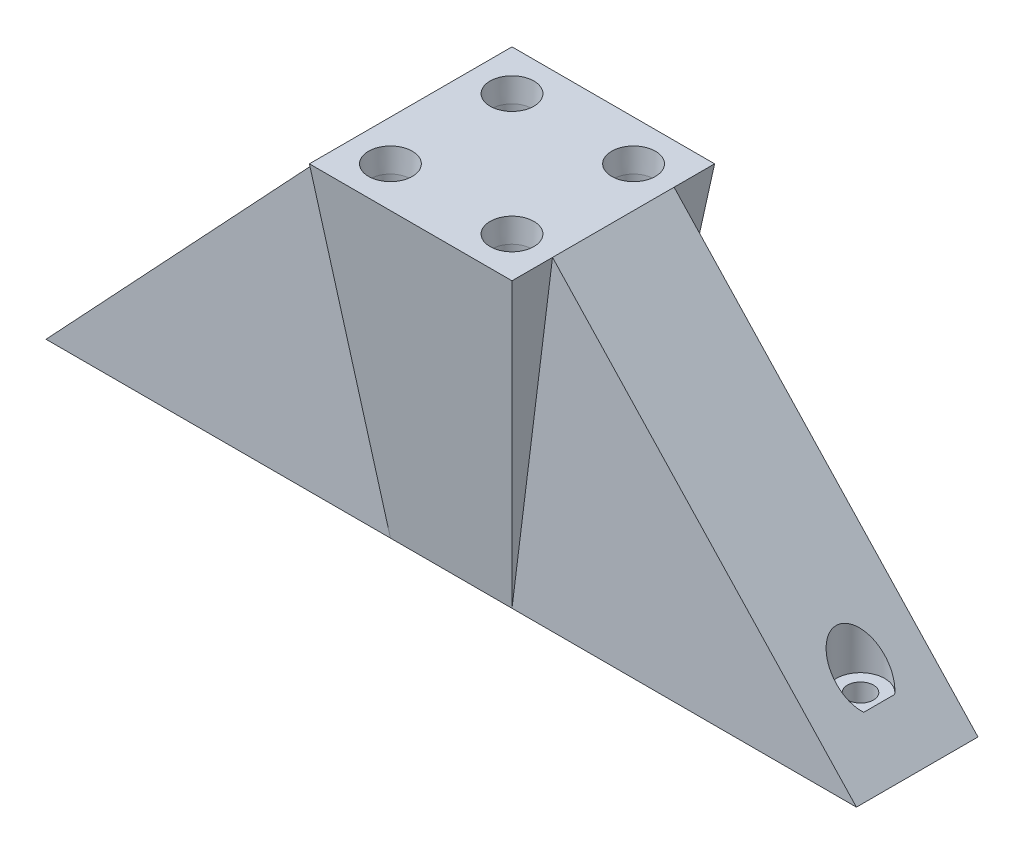
ISO-10303-21;
HEADER;
FILE_DESCRIPTION(('STEP AP214'),'2;1');
FILE_NAME('part.step','',(''),(''),'','','');
FILE_SCHEMA(('AUTOMOTIVE_DESIGN { 1 0 10303 214 1 1 1 1 }'));
ENDSEC;
DATA;
#1=APPLICATION_CONTEXT('core data for automotive mechanical design processes');
#2=APPLICATION_PROTOCOL_DEFINITION('international standard','automotive_design',2000,#1);
#3=PRODUCT_CONTEXT('',#1,'mechanical');
#4=PRODUCT('Part','Part','',(#3));
#5=PRODUCT_RELATED_PRODUCT_CATEGORY('part','',(#4));
#6=PRODUCT_DEFINITION_FORMATION('','',#4);
#7=PRODUCT_DEFINITION_CONTEXT('part definition',#1,'design');
#8=PRODUCT_DEFINITION('design','',#6,#7);
#9=PRODUCT_DEFINITION_SHAPE('','',#8);
#10=(LENGTH_UNIT() NAMED_UNIT(*) SI_UNIT(.MILLI.,.METRE.));
#11=(NAMED_UNIT(*) PLANE_ANGLE_UNIT() SI_UNIT($,.RADIAN.));
#12=(NAMED_UNIT(*) SI_UNIT($,.STERADIAN.) SOLID_ANGLE_UNIT());
#13=UNCERTAINTY_MEASURE_WITH_UNIT(LENGTH_MEASURE(1.E-05),#10,'distance_accuracy_value','');
#14=(GEOMETRIC_REPRESENTATION_CONTEXT(3) GLOBAL_UNCERTAINTY_ASSIGNED_CONTEXT((#13)) GLOBAL_UNIT_ASSIGNED_CONTEXT((#10,
#11,#12)) REPRESENTATION_CONTEXT('',''));
#15=CARTESIAN_POINT('',(0.,0.,0.));
#16=DIRECTION('',(0.,0.,1.));
#17=DIRECTION('',(1.,0.,0.));
#18=AXIS2_PLACEMENT_3D('',#15,#16,#17);
#19=CARTESIAN_POINT('',(-12.499988407975,40.,12.500988407975));
#20=DIRECTION('',(-0.729537098649694,0.683941241404396,0.));
#21=DIRECTION('',(-0.683941241404396,-0.729537098649694,0.));
#22=AXIS2_PLACEMENT_3D('',#19,#20,#21);
#23=PLANE('',#22);
#24=DIRECTION('',(0.,0.,-1.));
#25=VECTOR('',#24,1.);
#26=CARTESIAN_POINT('',(-12.499988407975,40.,12.500988407975));
#27=LINE('',#26,#25);
#28=CARTESIAN_POINT('',(-12.499988407975,40.,7.5));
#29=VERTEX_POINT('',#28);
#30=CARTESIAN_POINT('',(-12.499988407975,40.,-7.5));
#31=VERTEX_POINT('',#30);
#32=EDGE_CURVE('E179',#29,#31,#27,.T.);
#33=ORIENTED_EDGE('',*,*,#32,.T.);
#34=DIRECTION('',(0.683941241404396,0.729537098649694,0.));
#35=VECTOR('',#34,1.);
#36=CARTESIAN_POINT('',(-12.499988407975,40.,-7.5));
#37=LINE('',#36,#35);
#38=CARTESIAN_POINT('',(-50.,0.,-7.5));
#39=VERTEX_POINT('',#38);
#40=EDGE_CURVE('E176',#39,#31,#37,.T.);
#41=ORIENTED_EDGE('',*,*,#40,.F.);
#42=DIRECTION('',(0.,0.,1.));
#43=VECTOR('',#42,1.);
#44=CARTESIAN_POINT('',(-50.,0.,0.));
#45=LINE('',#44,#43);
#46=CARTESIAN_POINT('',(-50.,0.,7.5));
#47=VERTEX_POINT('',#46);
#48=EDGE_CURVE('E215',#39,#47,#45,.T.);
#49=ORIENTED_EDGE('',*,*,#48,.T.);
#50=DIRECTION('',(-0.683941241404396,-0.729537098649694,0.));
#51=VECTOR('',#50,1.);
#52=CARTESIAN_POINT('',(-12.499988407975,40.,7.5));
#53=LINE('',#52,#51);
#54=EDGE_CURVE('E181',#29,#47,#53,.T.);
#55=ORIENTED_EDGE('',*,*,#54,.F.);
#56=EDGE_LOOP('',(#33,#41,#49,#55));
#57=FACE_BOUND('',#56,.T.);
#58=DIRECTION('',(0.,0.,1.));
#59=VECTOR('',#58,1.);
#60=CARTESIAN_POINT('',(-45.3124985509969,5.,0.));
#61=LINE('',#60,#59);
#62=CARTESIAN_POINT('',(-45.3124985509969,5.,-1.91111235976259));
#63=VERTEX_POINT('',#62);
#64=CARTESIAN_POINT('',(-45.3124985509969,5.,1.91111235976259));
#65=VERTEX_POINT('',#64);
#66=EDGE_CURVE('E173',#63,#65,#61,.T.);
#67=ORIENTED_EDGE('',*,*,#66,.F.);
#68=CARTESIAN_POINT('',(-43.,7.46666435856641,0.));
#69=DIRECTION('',(0.729537098649694,-0.683941241404396,0.));
#70=DIRECTION('',(-0.683941241404396,-0.729537098649694,0.));
#71=AXIS2_PLACEMENT_3D('',#68,#69,#70);
#72=ELLIPSE('',#71,4.38634171824445,3.);
#73=EDGE_CURVE('E170',#63,#65,#72,.T.);
#74=ORIENTED_EDGE('',*,*,#73,.T.);
#75=EDGE_LOOP('',(#67,#74));
#76=FACE_BOUND('',#75,.T.);
#77=ADVANCED_FACE('F34',(#57,#76),#23,.T.);
#78=CARTESIAN_POINT('',(0.,40.,0.));
#79=DIRECTION('',(0.,1.,0.));
#80=DIRECTION('',(0.,0.,1.));
#81=AXIS2_PLACEMENT_3D('',#78,#79,#80);
#82=PLANE('',#81);
#83=CARTESIAN_POINT('',(7.50001159202505,40.,7.50001159202505));
#84=DIRECTION('',(0.,1.,0.));
#85=DIRECTION('',(0.,0.,1.));
#86=AXIS2_PLACEMENT_3D('',#83,#84,#85);
#87=CIRCLE('',#86,2.7);
#88=CARTESIAN_POINT('',(7.50001159202505,40.,10.200011592025));
#89=VERTEX_POINT('',#88);
#90=EDGE_CURVE('E140',#89,#89,#87,.T.);
#91=ORIENTED_EDGE('',*,*,#90,.F.);
#92=EDGE_LOOP('',(#91));
#93=FACE_BOUND('',#92,.T.);
#94=CARTESIAN_POINT('',(-7.49998840797495,40.,7.50001159202505));
#95=DIRECTION('',(0.,1.,0.));
#96=DIRECTION('',(0.,0.,1.));
#97=AXIS2_PLACEMENT_3D('',#94,#95,#96);
#98=CIRCLE('',#97,2.7);
#99=CARTESIAN_POINT('',(-7.49998840797495,40.,10.200011592025));
#100=VERTEX_POINT('',#99);
#101=EDGE_CURVE('E133',#100,#100,#98,.T.);
#102=ORIENTED_EDGE('',*,*,#101,.F.);
#103=EDGE_LOOP('',(#102));
#104=FACE_BOUND('',#103,.T.);
#105=CARTESIAN_POINT('',(7.50001159202505,40.,-7.49998840797495));
#106=DIRECTION('',(0.,1.,0.));
#107=DIRECTION('',(0.,0.,1.));
#108=AXIS2_PLACEMENT_3D('',#105,#106,#107);
#109=CIRCLE('',#108,2.7);
#110=CARTESIAN_POINT('',(7.50001159202505,40.,-4.79998840797495));
#111=VERTEX_POINT('',#110);
#112=EDGE_CURVE('E149',#111,#111,#109,.T.);
#113=ORIENTED_EDGE('',*,*,#112,.F.);
#114=EDGE_LOOP('',(#113));
#115=FACE_BOUND('',#114,.T.);
#116=CARTESIAN_POINT('',(-7.49998840797495,40.,-7.49998840797495));
#117=DIRECTION('',(0.,1.,0.));
#118=DIRECTION('',(0.,0.,1.));
#119=AXIS2_PLACEMENT_3D('',#116,#117,#118);
#120=CIRCLE('',#119,2.7);
#121=CARTESIAN_POINT('',(-7.49998840797495,40.,-4.79998840797495));
#122=VERTEX_POINT('',#121);
#123=EDGE_CURVE('E158',#122,#122,#120,.T.);
#124=ORIENTED_EDGE('',*,*,#123,.F.);
#125=EDGE_LOOP('',(#124));
#126=FACE_BOUND('',#125,.T.);
#127=DIRECTION('',(0.,0.,-1.));
#128=VECTOR('',#127,1.);
#129=CARTESIAN_POINT('',(-12.499988407975,40.,0.));
#130=LINE('',#129,#128);
#131=CARTESIAN_POINT('',(-12.499988407975,40.,-12.499988407975));
#132=VERTEX_POINT('',#131);
#133=EDGE_CURVE('E251',#132,#31,#130,.F.);
#134=ORIENTED_EDGE('',*,*,#133,.T.);
#135=ORIENTED_EDGE('',*,*,#32,.F.);
#136=CARTESIAN_POINT('',(-12.499988407975,40.,12.499988407975));
#137=VERTEX_POINT('',#136);
#138=EDGE_CURVE('E250',#29,#137,#130,.F.);
#139=ORIENTED_EDGE('',*,*,#138,.T.);
#140=DIRECTION('',(-1.,0.,0.));
#141=VECTOR('',#140,1.);
#142=CARTESIAN_POINT('',(0.,40.,12.499988407975));
#143=LINE('',#142,#141);
#144=CARTESIAN_POINT('',(12.499988407975,40.,12.499988407975));
#145=VERTEX_POINT('',#144);
#146=EDGE_CURVE('E240',#137,#145,#143,.F.);
#147=ORIENTED_EDGE('',*,*,#146,.T.);
#148=DIRECTION('',(0.,0.,1.));
#149=VECTOR('',#148,1.);
#150=CARTESIAN_POINT('',(12.499988407975,40.,0.));
#151=LINE('',#150,#149);
#152=CARTESIAN_POINT('',(12.499988407975,40.,7.5));
#153=VERTEX_POINT('',#152);
#154=EDGE_CURVE('E234',#153,#145,#151,.T.);
#155=ORIENTED_EDGE('',*,*,#154,.F.);
#156=DIRECTION('',(0.,0.,-1.));
#157=VECTOR('',#156,1.);
#158=CARTESIAN_POINT('',(12.499988407975,40.,12.500988407975));
#159=LINE('',#158,#157);
#160=CARTESIAN_POINT('',(12.499988407975,40.,-7.5));
#161=VERTEX_POINT('',#160);
#162=EDGE_CURVE('E197',#153,#161,#159,.T.);
#163=ORIENTED_EDGE('',*,*,#162,.T.);
#164=CARTESIAN_POINT('',(12.499988407975,40.,-12.499988407975));
#165=VERTEX_POINT('',#164);
#166=EDGE_CURVE('E244',#165,#161,#151,.T.);
#167=ORIENTED_EDGE('',*,*,#166,.F.);
#168=DIRECTION('',(1.,0.,0.));
#169=VECTOR('',#168,1.);
#170=CARTESIAN_POINT('',(0.,40.,-12.499988407975));
#171=LINE('',#170,#169);
#172=EDGE_CURVE('E247',#132,#165,#171,.T.);
#173=ORIENTED_EDGE('',*,*,#172,.F.);
#174=EDGE_LOOP('',(#134,#135,#139,#147,#155,#163,#167,#173));
#175=FACE_BOUND('',#174,.T.);
#176=ADVANCED_FACE('F278',(#93,#104,#115,#126,#175),#82,.T.);
#177=CARTESIAN_POINT('',(0.,85.0693909432999,-7.5));
#178=DIRECTION('',(0.,0.,-1.));
#179=DIRECTION('',(-1.,0.,0.));
#180=AXIS2_PLACEMENT_3D('',#177,#178,#179);
#181=PLANE('',#180);
#182=DIRECTION('',(1.,0.,0.));
#183=VECTOR('',#182,1.);
#184=CARTESIAN_POINT('',(0.,0.,-7.5));
#185=LINE('',#184,#183);
#186=CARTESIAN_POINT('',(-7.5,0.,-7.5));
#187=VERTEX_POINT('',#186);
#188=EDGE_CURVE('E219',#39,#187,#185,.T.);
#189=ORIENTED_EDGE('',*,*,#188,.F.);
#190=ORIENTED_EDGE('',*,*,#40,.T.);
#191=DIRECTION('',(0.124034451450486,-0.992277912105967,0.));
#192=VECTOR('',#191,1.);
#193=CARTESIAN_POINT('',(-7.5,0.,-7.5));
#194=LINE('',#193,#192);
#195=EDGE_CURVE('E226',#187,#31,#194,.F.);
#196=ORIENTED_EDGE('',*,*,#195,.F.);
#197=EDGE_LOOP('',(#189,#190,#196));
#198=FACE_BOUND('',#197,.T.);
#199=ADVANCED_FACE('F283',(#198),#181,.T.);
#200=CARTESIAN_POINT('',(0.,85.0693909432999,7.5));
#201=DIRECTION('',(0.,0.,-1.));
#202=DIRECTION('',(-1.,0.,0.));
#203=AXIS2_PLACEMENT_3D('',#200,#201,#202);
#204=PLANE('',#203);
#205=ORIENTED_EDGE('',*,*,#54,.T.);
#206=DIRECTION('',(1.,0.,0.));
#207=VECTOR('',#206,1.);
#208=CARTESIAN_POINT('',(0.,0.,7.5));
#209=LINE('',#208,#207);
#210=CARTESIAN_POINT('',(-7.5,0.,7.5));
#211=VERTEX_POINT('',#210);
#212=EDGE_CURVE('E216',#47,#211,#209,.T.);
#213=ORIENTED_EDGE('',*,*,#212,.T.);
#214=DIRECTION('',(0.124034451450486,-0.992277912105967,0.));
#215=VECTOR('',#214,1.);
#216=CARTESIAN_POINT('',(-7.5,0.,7.5));
#217=LINE('',#216,#215);
#218=EDGE_CURVE('E223',#211,#29,#217,.F.);
#219=ORIENTED_EDGE('',*,*,#218,.T.);
#220=EDGE_LOOP('',(#205,#213,#219));
#221=FACE_BOUND('',#220,.T.);
#222=ADVANCED_FACE('F363',(#221),#204,.F.);
#223=CARTESIAN_POINT('',(7.5,0.,0.));
#224=DIRECTION('',(0.992277912105967,-0.124034451450486,0.));
#225=DIRECTION('',(0.124034451450486,0.992277912105967,0.));
#226=AXIS2_PLACEMENT_3D('',#223,#224,#225);
#227=PLANE('',#226);
#228=DIRECTION('',(0.12309121425113,0.984731997016632,0.12309121425113));
#229=VECTOR('',#228,1.);
#230=CARTESIAN_POINT('',(7.38636414730637,-0.909088929185378,7.38636414730637));
#231=LINE('',#230,#229);
#232=CARTESIAN_POINT('',(7.5,0.,7.5));
#233=VERTEX_POINT('',#232);
#234=EDGE_CURVE('E236',#145,#233,#231,.F.);
#235=ORIENTED_EDGE('',*,*,#234,.T.);
#236=DIRECTION('',(0.124034451450486,0.992277912105967,0.));
#237=VECTOR('',#236,1.);
#238=CARTESIAN_POINT('',(7.5,0.,7.5));
#239=LINE('',#238,#237);
#240=EDGE_CURVE('E212',#233,#153,#239,.T.);
#241=ORIENTED_EDGE('',*,*,#240,.T.);
#242=ORIENTED_EDGE('',*,*,#154,.T.);
#243=EDGE_LOOP('',(#235,#241,#242));
#244=FACE_BOUND('',#243,.T.);
#245=ADVANCED_FACE('F374',(#244),#227,.T.);
#246=CARTESIAN_POINT('',(-7.5,0.,0.));
#247=DIRECTION('',(-0.992277912105967,-0.124034451450486,0.));
#248=DIRECTION('',(0.124034451450486,-0.992277912105967,0.));
#249=AXIS2_PLACEMENT_3D('',#246,#247,#248);
#250=PLANE('',#249);
#251=ORIENTED_EDGE('',*,*,#218,.F.);
#252=DIRECTION('',(0.12309121425113,-0.984731997016632,-0.12309121425113));
#253=VECTOR('',#252,1.);
#254=CARTESIAN_POINT('',(-7.38636414730637,-0.909088929185378,7.38636414730637));
#255=LINE('',#254,#253);
#256=EDGE_CURVE('E239',#137,#211,#255,.T.);
#257=ORIENTED_EDGE('',*,*,#256,.F.);
#258=ORIENTED_EDGE('',*,*,#138,.F.);
#259=EDGE_LOOP('',(#251,#257,#258));
#260=FACE_BOUND('',#259,.T.);
#261=ADVANCED_FACE('F367',(#260),#250,.T.);
#262=DIRECTION('',(0.124034451450486,0.992277912105967,0.));
#263=VECTOR('',#262,1.);
#264=CARTESIAN_POINT('',(7.5,0.,-7.5));
#265=LINE('',#264,#263);
#266=CARTESIAN_POINT('',(7.5,0.,-7.5));
#267=VERTEX_POINT('',#266);
#268=EDGE_CURVE('E207',#267,#161,#265,.T.);
#269=ORIENTED_EDGE('',*,*,#268,.F.);
#270=DIRECTION('',(-0.12309121425113,-0.984731997016632,0.12309121425113));
#271=VECTOR('',#270,1.);
#272=CARTESIAN_POINT('',(7.38636414730637,-0.909088929185378,-7.38636414730637));
#273=LINE('',#272,#271);
#274=EDGE_CURVE('E11',#165,#267,#273,.T.);
#275=ORIENTED_EDGE('',*,*,#274,.F.);
#276=ORIENTED_EDGE('',*,*,#166,.T.);
#277=EDGE_LOOP('',(#269,#275,#276));
#278=FACE_BOUND('',#277,.T.);
#279=ADVANCED_FACE('F386',(#278),#227,.T.);
#280=CARTESIAN_POINT('',(0.,0.,-7.5));
#281=DIRECTION('',(0.,-0.124034451450486,-0.992277912105967));
#282=DIRECTION('',(0.,0.992277912105967,-0.124034451450486));
#283=AXIS2_PLACEMENT_3D('',#280,#281,#282);
#284=PLANE('',#283);
#285=DIRECTION('',(1.,0.,0.));
#286=VECTOR('',#285,1.);
#287=CARTESIAN_POINT('',(0.,0.,-7.5));
#288=LINE('',#287,#286);
#289=EDGE_CURVE('E229',#187,#267,#288,.T.);
#290=ORIENTED_EDGE('',*,*,#289,.F.);
#291=DIRECTION('',(-0.12309121425113,0.984731997016632,-0.12309121425113));
#292=VECTOR('',#291,1.);
#293=CARTESIAN_POINT('',(-7.38636414730637,-0.909088929185378,-7.38636414730637));
#294=LINE('',#293,#292);
#295=EDGE_CURVE('E43',#132,#187,#294,.F.);
#296=ORIENTED_EDGE('',*,*,#295,.F.);
#297=ORIENTED_EDGE('',*,*,#172,.T.);
#298=ORIENTED_EDGE('',*,*,#274,.T.);
#299=EDGE_LOOP('',(#290,#296,#297,#298));
#300=FACE_BOUND('',#299,.T.);
#301=ADVANCED_FACE('F36',(#300),#284,.T.);
#302=ORIENTED_EDGE('',*,*,#295,.T.);
#303=ORIENTED_EDGE('',*,*,#195,.T.);
#304=ORIENTED_EDGE('',*,*,#133,.F.);
#305=EDGE_LOOP('',(#302,#303,#304));
#306=FACE_BOUND('',#305,.T.);
#307=ADVANCED_FACE('F353',(#306),#250,.T.);
#308=CARTESIAN_POINT('',(0.,0.,7.5));
#309=DIRECTION('',(0.,-0.124034451450486,0.992277912105967));
#310=DIRECTION('',(0.,-0.992277912105967,-0.124034451450486));
#311=AXIS2_PLACEMENT_3D('',#308,#309,#310);
#312=PLANE('',#311);
#313=DIRECTION('',(1.,0.,0.));
#314=VECTOR('',#313,1.);
#315=CARTESIAN_POINT('',(0.,0.,7.5));
#316=LINE('',#315,#314);
#317=EDGE_CURVE('E232',#211,#233,#316,.T.);
#318=ORIENTED_EDGE('',*,*,#317,.T.);
#319=ORIENTED_EDGE('',*,*,#234,.F.);
#320=ORIENTED_EDGE('',*,*,#146,.F.);
#321=ORIENTED_EDGE('',*,*,#256,.T.);
#322=EDGE_LOOP('',(#318,#319,#320,#321));
#323=FACE_BOUND('',#322,.T.);
#324=ADVANCED_FACE('F372',(#323),#312,.T.);
#325=CARTESIAN_POINT('',(0.,0.,0.));
#326=DIRECTION('',(0.,1.,0.));
#327=DIRECTION('',(0.,0.,1.));
#328=AXIS2_PLACEMENT_3D('',#325,#326,#327);
#329=PLANE('',#328);
#330=CARTESIAN_POINT('',(-43.,0.,0.));
#331=DIRECTION('',(0.,1.,0.));
#332=DIRECTION('',(0.,0.,-1.));
#333=AXIS2_PLACEMENT_3D('',#330,#331,#332);
#334=CIRCLE('',#333,1.6);
#335=CARTESIAN_POINT('',(-43.,0.,-1.6));
#336=VERTEX_POINT('',#335);
#337=EDGE_CURVE('E167',#336,#336,#334,.T.);
#338=ORIENTED_EDGE('',*,*,#337,.T.);
#339=EDGE_LOOP('',(#338));
#340=FACE_BOUND('',#339,.T.);
#341=CARTESIAN_POINT('',(43.,0.,0.));
#342=DIRECTION('',(0.,-1.,0.));
#343=DIRECTION('',(0.,0.,-1.));
#344=AXIS2_PLACEMENT_3D('',#341,#342,#343);
#345=CIRCLE('',#344,1.6);
#346=CARTESIAN_POINT('',(43.,0.,-1.6));
#347=VERTEX_POINT('',#346);
#348=EDGE_CURVE('E184',#347,#347,#345,.T.);
#349=ORIENTED_EDGE('',*,*,#348,.F.);
#350=EDGE_LOOP('',(#349));
#351=FACE_BOUND('',#350,.T.);
#352=ORIENTED_EDGE('',*,*,#289,.T.);
#353=DIRECTION('',(1.,0.,0.));
#354=VECTOR('',#353,1.);
#355=CARTESIAN_POINT('',(0.,0.,-7.5));
#356=LINE('',#355,#354);
#357=CARTESIAN_POINT('',(50.,0.,-7.5));
#358=VERTEX_POINT('',#357);
#359=EDGE_CURVE('E200',#267,#358,#356,.T.);
#360=ORIENTED_EDGE('',*,*,#359,.T.);
#361=DIRECTION('',(0.,0.,1.));
#362=VECTOR('',#361,1.);
#363=CARTESIAN_POINT('',(50.,0.,0.));
#364=LINE('',#363,#362);
#365=CARTESIAN_POINT('',(50.,0.,7.5));
#366=VERTEX_POINT('',#365);
#367=EDGE_CURVE('E201',#358,#366,#364,.T.);
#368=ORIENTED_EDGE('',*,*,#367,.T.);
#369=DIRECTION('',(1.,0.,0.));
#370=VECTOR('',#369,1.);
#371=CARTESIAN_POINT('',(0.,0.,7.5));
#372=LINE('',#371,#370);
#373=EDGE_CURVE('E204',#233,#366,#372,.T.);
#374=ORIENTED_EDGE('',*,*,#373,.F.);
#375=ORIENTED_EDGE('',*,*,#317,.F.);
#376=ORIENTED_EDGE('',*,*,#212,.F.);
#377=ORIENTED_EDGE('',*,*,#48,.F.);
#378=ORIENTED_EDGE('',*,*,#188,.T.);
#379=EDGE_LOOP('',(#352,#360,#368,#374,#375,#376,#377,#378));
#380=FACE_BOUND('',#379,.T.);
#381=ADVANCED_FACE('F360',(#340,#351,#380),#329,.F.);
#382=CARTESIAN_POINT('',(0.,85.0693909432999,7.5));
#383=DIRECTION('',(0.,0.,-1.));
#384=DIRECTION('',(-1.,0.,0.));
#385=AXIS2_PLACEMENT_3D('',#382,#383,#384);
#386=PLANE('',#385);
#387=ORIENTED_EDGE('',*,*,#373,.T.);
#388=DIRECTION('',(0.683941241404396,-0.729537098649694,0.));
#389=VECTOR('',#388,1.);
#390=CARTESIAN_POINT('',(12.499988407975,40.,7.5));
#391=LINE('',#390,#389);
#392=EDGE_CURVE('E193',#153,#366,#391,.T.);
#393=ORIENTED_EDGE('',*,*,#392,.F.);
#394=ORIENTED_EDGE('',*,*,#240,.F.);
#395=EDGE_LOOP('',(#387,#393,#394));
#396=FACE_BOUND('',#395,.T.);
#397=ADVANCED_FACE('F378',(#396),#386,.F.);
#398=CARTESIAN_POINT('',(0.,85.0693909432999,-7.5));
#399=DIRECTION('',(0.,0.,-1.));
#400=DIRECTION('',(-1.,0.,0.));
#401=AXIS2_PLACEMENT_3D('',#398,#399,#400);
#402=PLANE('',#401);
#403=DIRECTION('',(-0.683941241404396,0.729537098649694,0.));
#404=VECTOR('',#403,1.);
#405=CARTESIAN_POINT('',(12.499988407975,40.,-7.5));
#406=LINE('',#405,#404);
#407=EDGE_CURVE('E195',#358,#161,#406,.T.);
#408=ORIENTED_EDGE('',*,*,#407,.F.);
#409=ORIENTED_EDGE('',*,*,#359,.F.);
#410=ORIENTED_EDGE('',*,*,#268,.T.);
#411=EDGE_LOOP('',(#408,#409,#410));
#412=FACE_BOUND('',#411,.T.);
#413=ADVANCED_FACE('F384',(#412),#402,.T.);
#414=CARTESIAN_POINT('',(12.499988407975,40.,12.500988407975));
#415=DIRECTION('',(-0.729537098649694,-0.683941241404396,0.));
#416=DIRECTION('',(0.683941241404396,-0.729537098649694,0.));
#417=AXIS2_PLACEMENT_3D('',#414,#415,#416);
#418=PLANE('',#417);
#419=CARTESIAN_POINT('',(43.,7.4666643585664,0.));
#420=DIRECTION('',(-0.729537098649694,-0.683941241404396,0.));
#421=DIRECTION('',(0.683941241404396,-0.729537098649694,0.));
#422=AXIS2_PLACEMENT_3D('',#419,#420,#421);
#423=ELLIPSE('',#422,4.38634171824445,3.);
#424=CARTESIAN_POINT('',(45.3124985509969,5.,-1.91111235976259));
#425=VERTEX_POINT('',#424);
#426=CARTESIAN_POINT('',(45.3124985509969,5.,1.91111235976259));
#427=VERTEX_POINT('',#426);
#428=EDGE_CURVE('E188',#425,#427,#423,.F.);
#429=ORIENTED_EDGE('',*,*,#428,.F.);
#430=DIRECTION('',(0.,0.,-1.));
#431=VECTOR('',#430,1.);
#432=CARTESIAN_POINT('',(45.3124985509969,5.,0.));
#433=LINE('',#432,#431);
#434=EDGE_CURVE('E190',#427,#425,#433,.T.);
#435=ORIENTED_EDGE('',*,*,#434,.F.);
#436=EDGE_LOOP('',(#429,#435));
#437=FACE_BOUND('',#436,.T.);
#438=ORIENTED_EDGE('',*,*,#392,.T.);
#439=ORIENTED_EDGE('',*,*,#367,.F.);
#440=ORIENTED_EDGE('',*,*,#407,.T.);
#441=ORIENTED_EDGE('',*,*,#162,.F.);
#442=EDGE_LOOP('',(#438,#439,#440,#441));
#443=FACE_BOUND('',#442,.T.);
#444=ADVANCED_FACE('F380',(#437,#443),#418,.F.);
#445=CARTESIAN_POINT('',(0.,5.,0.));
#446=DIRECTION('',(0.,-1.,0.));
#447=DIRECTION('',(0.,0.,-1.));
#448=AXIS2_PLACEMENT_3D('',#445,#446,#447);
#449=PLANE('',#448);
#450=CARTESIAN_POINT('',(43.,5.,0.));
#451=DIRECTION('',(0.,-1.,0.));
#452=DIRECTION('',(0.,0.,-1.));
#453=AXIS2_PLACEMENT_3D('',#450,#451,#452);
#454=CIRCLE('',#453,1.6);
#455=CARTESIAN_POINT('',(43.,5.,-1.6));
#456=VERTEX_POINT('',#455);
#457=EDGE_CURVE('E187',#456,#456,#454,.T.);
#458=ORIENTED_EDGE('',*,*,#457,.T.);
#459=EDGE_LOOP('',(#458));
#460=FACE_BOUND('',#459,.T.);
#461=ORIENTED_EDGE('',*,*,#434,.T.);
#462=CARTESIAN_POINT('',(43.,5.,0.));
#463=DIRECTION('',(0.,-1.,0.));
#464=DIRECTION('',(0.,0.,-1.));
#465=AXIS2_PLACEMENT_3D('',#462,#463,#464);
#466=CIRCLE('',#465,3.);
#467=EDGE_CURVE('E57',#427,#425,#466,.T.);
#468=ORIENTED_EDGE('',*,*,#467,.F.);
#469=EDGE_LOOP('',(#461,#468));
#470=FACE_BOUND('',#469,.T.);
#471=ADVANCED_FACE('F258',(#460,#470),#449,.F.);
#472=CARTESIAN_POINT('',(43.,17.9125289928299,0.));
#473=DIRECTION('',(0.,-1.,0.));
#474=DIRECTION('',(0.,0.,-1.));
#475=AXIS2_PLACEMENT_3D('',#472,#473,#474);
#476=CYLINDRICAL_SURFACE('',#475,3.);
#477=ORIENTED_EDGE('',*,*,#428,.T.);
#478=ORIENTED_EDGE('',*,*,#467,.T.);
#479=EDGE_LOOP('',(#477,#478));
#480=FACE_BOUND('',#479,.T.);
#481=ADVANCED_FACE('F264',(#480),#476,.F.);
#482=CARTESIAN_POINT('',(43.,40.,0.));
#483=DIRECTION('',(0.,-1.,0.));
#484=DIRECTION('',(0.,0.,-1.));
#485=AXIS2_PLACEMENT_3D('',#482,#483,#484);
#486=CYLINDRICAL_SURFACE('',#485,1.6);
#487=ORIENTED_EDGE('',*,*,#348,.T.);
#488=EDGE_LOOP('',(#487));
#489=FACE_BOUND('',#488,.T.);
#490=ORIENTED_EDGE('',*,*,#457,.F.);
#491=EDGE_LOOP('',(#490));
#492=FACE_BOUND('',#491,.T.);
#493=ADVANCED_FACE('F261',(#489,#492),#486,.F.);
#494=CARTESIAN_POINT('',(0.,5.,0.));
#495=DIRECTION('',(0.,-1.,0.));
#496=DIRECTION('',(0.,0.,-1.));
#497=AXIS2_PLACEMENT_3D('',#494,#495,#496);
#498=PLANE('',#497);
#499=CARTESIAN_POINT('',(-43.,5.,0.));
#500=DIRECTION('',(0.,-1.,0.));
#501=DIRECTION('',(0.,0.,-1.));
#502=AXIS2_PLACEMENT_3D('',#499,#500,#501);
#503=CIRCLE('',#502,1.6);
#504=CARTESIAN_POINT('',(-43.,5.,-1.6));
#505=VERTEX_POINT('',#504);
#506=EDGE_CURVE('E38',#505,#505,#503,.F.);
#507=ORIENTED_EDGE('',*,*,#506,.F.);
#508=EDGE_LOOP('',(#507));
#509=FACE_BOUND('',#508,.T.);
#510=ORIENTED_EDGE('',*,*,#66,.T.);
#511=CARTESIAN_POINT('',(-43.,5.,0.));
#512=DIRECTION('',(0.,1.,0.));
#513=DIRECTION('',(0.,0.,-1.));
#514=AXIS2_PLACEMENT_3D('',#511,#512,#513);
#515=CIRCLE('',#514,3.);
#516=EDGE_CURVE('E50',#65,#63,#515,.T.);
#517=ORIENTED_EDGE('',*,*,#516,.T.);
#518=EDGE_LOOP('',(#510,#517));
#519=FACE_BOUND('',#518,.T.);
#520=ADVANCED_FACE('F263',(#509,#519),#498,.F.);
#521=CARTESIAN_POINT('',(-43.,109.645833969503,0.));
#522=DIRECTION('',(0.,-1.,0.));
#523=DIRECTION('',(0.,0.,-1.));
#524=AXIS2_PLACEMENT_3D('',#521,#522,#523);
#525=CYLINDRICAL_SURFACE('',#524,3.);
#526=ORIENTED_EDGE('',*,*,#516,.F.);
#527=ORIENTED_EDGE('',*,*,#73,.F.);
#528=EDGE_LOOP('',(#526,#527));
#529=FACE_BOUND('',#528,.T.);
#530=ADVANCED_FACE('F271',(#529),#525,.F.);
#531=CARTESIAN_POINT('',(-43.,40.,0.));
#532=DIRECTION('',(0.,-1.,0.));
#533=DIRECTION('',(0.,0.,-1.));
#534=AXIS2_PLACEMENT_3D('',#531,#532,#533);
#535=CYLINDRICAL_SURFACE('',#534,1.6);
#536=ORIENTED_EDGE('',*,*,#337,.F.);
#537=EDGE_LOOP('',(#536));
#538=FACE_BOUND('',#537,.T.);
#539=ORIENTED_EDGE('',*,*,#506,.T.);
#540=EDGE_LOOP('',(#539));
#541=FACE_BOUND('',#540,.T.);
#542=ADVANCED_FACE('F289',(#538,#541),#535,.F.);
#543=CARTESIAN_POINT('',(-7.49998840797495,30.,-7.49998840797495));
#544=DIRECTION('',(0.,1.,0.));
#545=DIRECTION('',(0.,0.,1.));
#546=AXIS2_PLACEMENT_3D('',#543,#544,#545);
#547=CONICAL_SURFACE('',#546,2.49999999999999,1.02974425867665);
#548=CARTESIAN_POINT('',(-7.49998840797496,28.4978484524311,-7.49998840797495));
#549=VERTEX_POINT('',#548);
#550=VERTEX_LOOP('',#549);
#551=FACE_BOUND('',#550,.T.);
#552=CARTESIAN_POINT('',(-7.49998840797495,30.,-7.49998840797495));
#553=DIRECTION('',(0.,1.,0.));
#554=DIRECTION('',(0.,0.,1.));
#555=AXIS2_PLACEMENT_3D('',#552,#553,#554);
#556=CIRCLE('',#555,2.49999999999999);
#557=CARTESIAN_POINT('',(-7.49998840797495,30.,-4.99998840797496));
#558=VERTEX_POINT('',#557);
#559=EDGE_CURVE('E164',#558,#558,#556,.T.);
#560=ORIENTED_EDGE('',*,*,#559,.T.);
#561=EDGE_LOOP('',(#560));
#562=FACE_BOUND('',#561,.T.);
#563=ADVANCED_FACE('F293',(#551,#562),#547,.F.);
#564=CARTESIAN_POINT('',(-7.49998840797495,40.,-7.49998840797495));
#565=DIRECTION('',(0.,1.,0.));
#566=DIRECTION('',(0.,0.,1.));
#567=AXIS2_PLACEMENT_3D('',#564,#565,#566);
#568=CYLINDRICAL_SURFACE('',#567,2.49999999999999);
#569=ORIENTED_EDGE('',*,*,#559,.F.);
#570=EDGE_LOOP('',(#569));
#571=FACE_BOUND('',#570,.T.);
#572=CARTESIAN_POINT('',(-7.49998840797495,37.1398667486576,-7.49998840797495));
#573=DIRECTION('',(0.,1.,0.));
#574=DIRECTION('',(0.,0.,1.));
#575=AXIS2_PLACEMENT_3D('',#572,#573,#574);
#576=CIRCLE('',#575,2.49999999999999);
#577=CARTESIAN_POINT('',(-7.49998840797495,37.1398667486576,-4.99998840797496));
#578=VERTEX_POINT('',#577);
#579=EDGE_CURVE('E161',#578,#578,#576,.T.);
#580=ORIENTED_EDGE('',*,*,#579,.T.);
#581=EDGE_LOOP('',(#580));
#582=FACE_BOUND('',#581,.T.);
#583=ADVANCED_FACE('F297',(#571,#582),#568,.F.);
#584=CARTESIAN_POINT('',(-7.49998840797495,40.,-7.49998840797495));
#585=DIRECTION('',(0.,1.,0.));
#586=DIRECTION('',(0.,0.,1.));
#587=AXIS2_PLACEMENT_3D('',#584,#585,#586);
#588=CONICAL_SURFACE('',#587,2.7,0.0698131700797741);
#589=ORIENTED_EDGE('',*,*,#579,.F.);
#590=EDGE_LOOP('',(#589));
#591=FACE_BOUND('',#590,.T.);
#592=ORIENTED_EDGE('',*,*,#123,.T.);
#593=EDGE_LOOP('',(#592));
#594=FACE_BOUND('',#593,.T.);
#595=ADVANCED_FACE('F301',(#591,#594),#588,.F.);
#596=CARTESIAN_POINT('',(7.50001159202505,30.,-7.49998840797495));
#597=DIRECTION('',(0.,1.,0.));
#598=DIRECTION('',(0.,0.,1.));
#599=AXIS2_PLACEMENT_3D('',#596,#597,#598);
#600=CONICAL_SURFACE('',#599,2.49999999999999,1.02974425867665);
#601=CARTESIAN_POINT('',(7.50001159202504,28.4978484524311,-7.49998840797495));
#602=VERTEX_POINT('',#601);
#603=VERTEX_LOOP('',#602);
#604=FACE_BOUND('',#603,.T.);
#605=CARTESIAN_POINT('',(7.50001159202505,30.,-7.49998840797495));
#606=DIRECTION('',(0.,1.,0.));
#607=DIRECTION('',(0.,0.,1.));
#608=AXIS2_PLACEMENT_3D('',#605,#606,#607);
#609=CIRCLE('',#608,2.49999999999999);
#610=CARTESIAN_POINT('',(7.50001159202505,30.,-4.99998840797496));
#611=VERTEX_POINT('',#610);
#612=EDGE_CURVE('E155',#611,#611,#609,.T.);
#613=ORIENTED_EDGE('',*,*,#612,.T.);
#614=EDGE_LOOP('',(#613));
#615=FACE_BOUND('',#614,.T.);
#616=ADVANCED_FACE('F305',(#604,#615),#600,.F.);
#617=CARTESIAN_POINT('',(7.50001159202505,40.,-7.49998840797495));
#618=DIRECTION('',(0.,1.,0.));
#619=DIRECTION('',(0.,0.,1.));
#620=AXIS2_PLACEMENT_3D('',#617,#618,#619);
#621=CYLINDRICAL_SURFACE('',#620,2.49999999999999);
#622=ORIENTED_EDGE('',*,*,#612,.F.);
#623=EDGE_LOOP('',(#622));
#624=FACE_BOUND('',#623,.T.);
#625=CARTESIAN_POINT('',(7.50001159202505,37.1398667486576,-7.49998840797495));
#626=DIRECTION('',(0.,1.,0.));
#627=DIRECTION('',(0.,0.,1.));
#628=AXIS2_PLACEMENT_3D('',#625,#626,#627);
#629=CIRCLE('',#628,2.49999999999999);
#630=CARTESIAN_POINT('',(7.50001159202505,37.1398667486576,-4.99998840797496));
#631=VERTEX_POINT('',#630);
#632=EDGE_CURVE('E152',#631,#631,#629,.T.);
#633=ORIENTED_EDGE('',*,*,#632,.T.);
#634=EDGE_LOOP('',(#633));
#635=FACE_BOUND('',#634,.T.);
#636=ADVANCED_FACE('F309',(#624,#635),#621,.F.);
#637=CARTESIAN_POINT('',(7.50001159202505,40.,-7.49998840797495));
#638=DIRECTION('',(0.,1.,0.));
#639=DIRECTION('',(0.,0.,1.));
#640=AXIS2_PLACEMENT_3D('',#637,#638,#639);
#641=CONICAL_SURFACE('',#640,2.7,0.0698131700797744);
#642=ORIENTED_EDGE('',*,*,#632,.F.);
#643=EDGE_LOOP('',(#642));
#644=FACE_BOUND('',#643,.T.);
#645=ORIENTED_EDGE('',*,*,#112,.T.);
#646=EDGE_LOOP('',(#645));
#647=FACE_BOUND('',#646,.T.);
#648=ADVANCED_FACE('F313',(#644,#647),#641,.F.);
#649=CARTESIAN_POINT('',(-7.49998840797495,30.,7.50001159202505));
#650=DIRECTION('',(0.,1.,0.));
#651=DIRECTION('',(0.,0.,1.));
#652=AXIS2_PLACEMENT_3D('',#649,#650,#651);
#653=CONICAL_SURFACE('',#652,2.49999999999999,1.02974425867665);
#654=CARTESIAN_POINT('',(-7.49998840797496,28.4978484524311,7.50001159202505));
#655=VERTEX_POINT('',#654);
#656=VERTEX_LOOP('',#655);
#657=FACE_BOUND('',#656,.T.);
#658=CARTESIAN_POINT('',(-7.49998840797495,30.,7.50001159202505));
#659=DIRECTION('',(0.,1.,0.));
#660=DIRECTION('',(0.,0.,1.));
#661=AXIS2_PLACEMENT_3D('',#658,#659,#660);
#662=CIRCLE('',#661,2.49999999999999);
#663=CARTESIAN_POINT('',(-7.49998840797495,30.,10.000011592025));
#664=VERTEX_POINT('',#663);
#665=EDGE_CURVE('E146',#664,#664,#662,.T.);
#666=ORIENTED_EDGE('',*,*,#665,.T.);
#667=EDGE_LOOP('',(#666));
#668=FACE_BOUND('',#667,.T.);
#669=ADVANCED_FACE('F317',(#657,#668),#653,.F.);
#670=CARTESIAN_POINT('',(-7.49998840797495,40.,7.50001159202505));
#671=DIRECTION('',(0.,1.,0.));
#672=DIRECTION('',(0.,0.,1.));
#673=AXIS2_PLACEMENT_3D('',#670,#671,#672);
#674=CYLINDRICAL_SURFACE('',#673,2.49999999999999);
#675=ORIENTED_EDGE('',*,*,#665,.F.);
#676=EDGE_LOOP('',(#675));
#677=FACE_BOUND('',#676,.T.);
#678=CARTESIAN_POINT('',(-7.49998840797495,37.1398667486576,7.50001159202505));
#679=DIRECTION('',(0.,1.,0.));
#680=DIRECTION('',(0.,0.,1.));
#681=AXIS2_PLACEMENT_3D('',#678,#679,#680);
#682=CIRCLE('',#681,2.49999999999999);
#683=CARTESIAN_POINT('',(-7.49998840797495,37.1398667486576,10.000011592025));
#684=VERTEX_POINT('',#683);
#685=EDGE_CURVE('E137',#684,#684,#682,.T.);
#686=ORIENTED_EDGE('',*,*,#685,.T.);
#687=EDGE_LOOP('',(#686));
#688=FACE_BOUND('',#687,.T.);
#689=ADVANCED_FACE('F321',(#677,#688),#674,.F.);
#690=CARTESIAN_POINT('',(-7.49998840797495,40.,7.50001159202505));
#691=DIRECTION('',(0.,1.,0.));
#692=DIRECTION('',(0.,0.,1.));
#693=AXIS2_PLACEMENT_3D('',#690,#691,#692);
#694=CONICAL_SURFACE('',#693,2.7,0.0698131700797741);
#695=ORIENTED_EDGE('',*,*,#685,.F.);
#696=EDGE_LOOP('',(#695));
#697=FACE_BOUND('',#696,.T.);
#698=ORIENTED_EDGE('',*,*,#101,.T.);
#699=EDGE_LOOP('',(#698));
#700=FACE_BOUND('',#699,.T.);
#701=ADVANCED_FACE('F127',(#697,#700),#694,.F.);
#702=CARTESIAN_POINT('',(7.50001159202505,30.,7.50001159202505));
#703=DIRECTION('',(0.,1.,0.));
#704=DIRECTION('',(0.,0.,1.));
#705=AXIS2_PLACEMENT_3D('',#702,#703,#704);
#706=CONICAL_SURFACE('',#705,2.49999999999999,1.02974425867665);
#707=CARTESIAN_POINT('',(7.50001159202504,28.4978484524311,7.50001159202505));
#708=VERTEX_POINT('',#707);
#709=VERTEX_LOOP('',#708);
#710=FACE_BOUND('',#709,.T.);
#711=CARTESIAN_POINT('',(7.50001159202505,30.,7.50001159202505));
#712=DIRECTION('',(0.,1.,0.));
#713=DIRECTION('',(0.,0.,1.));
#714=AXIS2_PLACEMENT_3D('',#711,#712,#713);
#715=CIRCLE('',#714,2.49999999999999);
#716=CARTESIAN_POINT('',(7.50001159202505,30.,10.000011592025));
#717=VERTEX_POINT('',#716);
#718=EDGE_CURVE('E131',#717,#717,#715,.T.);
#719=ORIENTED_EDGE('',*,*,#718,.T.);
#720=EDGE_LOOP('',(#719));
#721=FACE_BOUND('',#720,.T.);
#722=ADVANCED_FACE('F123',(#710,#721),#706,.F.);
#723=CARTESIAN_POINT('',(7.50001159202505,40.,7.50001159202505));
#724=DIRECTION('',(0.,1.,0.));
#725=DIRECTION('',(0.,0.,1.));
#726=AXIS2_PLACEMENT_3D('',#723,#724,#725);
#727=CYLINDRICAL_SURFACE('',#726,2.49999999999999);
#728=ORIENTED_EDGE('',*,*,#718,.F.);
#729=EDGE_LOOP('',(#728));
#730=FACE_BOUND('',#729,.T.);
#731=CARTESIAN_POINT('',(7.50001159202505,37.1398667486576,7.50001159202505));
#732=DIRECTION('',(0.,1.,0.));
#733=DIRECTION('',(0.,0.,1.));
#734=AXIS2_PLACEMENT_3D('',#731,#732,#733);
#735=CIRCLE('',#734,2.49999999999999);
#736=CARTESIAN_POINT('',(7.50001159202505,37.1398667486576,10.000011592025));
#737=VERTEX_POINT('',#736);
#738=EDGE_CURVE('E134',#737,#737,#735,.T.);
#739=ORIENTED_EDGE('',*,*,#738,.T.);
#740=EDGE_LOOP('',(#739));
#741=FACE_BOUND('',#740,.T.);
#742=ADVANCED_FACE('F126',(#730,#741),#727,.F.);
#743=CARTESIAN_POINT('',(7.50001159202505,40.,7.50001159202505));
#744=DIRECTION('',(0.,1.,0.));
#745=DIRECTION('',(0.,0.,1.));
#746=AXIS2_PLACEMENT_3D('',#743,#744,#745);
#747=CONICAL_SURFACE('',#746,2.7,0.0698131700797744);
#748=ORIENTED_EDGE('',*,*,#738,.F.);
#749=EDGE_LOOP('',(#748));
#750=FACE_BOUND('',#749,.T.);
#751=ORIENTED_EDGE('',*,*,#90,.T.);
#752=EDGE_LOOP('',(#751));
#753=FACE_BOUND('',#752,.T.);
#754=ADVANCED_FACE('F331',(#750,#753),#747,.F.);
#755=CLOSED_SHELL('',(#77,#176,#199,#222,#245,#261,#279,#301,#307,#324,#381,#397,#413,#444,#471,
#481,#493,#520,#530,#542,#563,#583,#595,#616,#636,#648,#669,#689,#701,#722,#742,#754));
#756=MANIFOLD_SOLID_BREP('B2',#755);
#757=ADVANCED_BREP_SHAPE_REPRESENTATION('',(#18,#756),#14);
#758=SHAPE_DEFINITION_REPRESENTATION(#9,#757);
ENDSEC;
END-ISO-10303-21;
